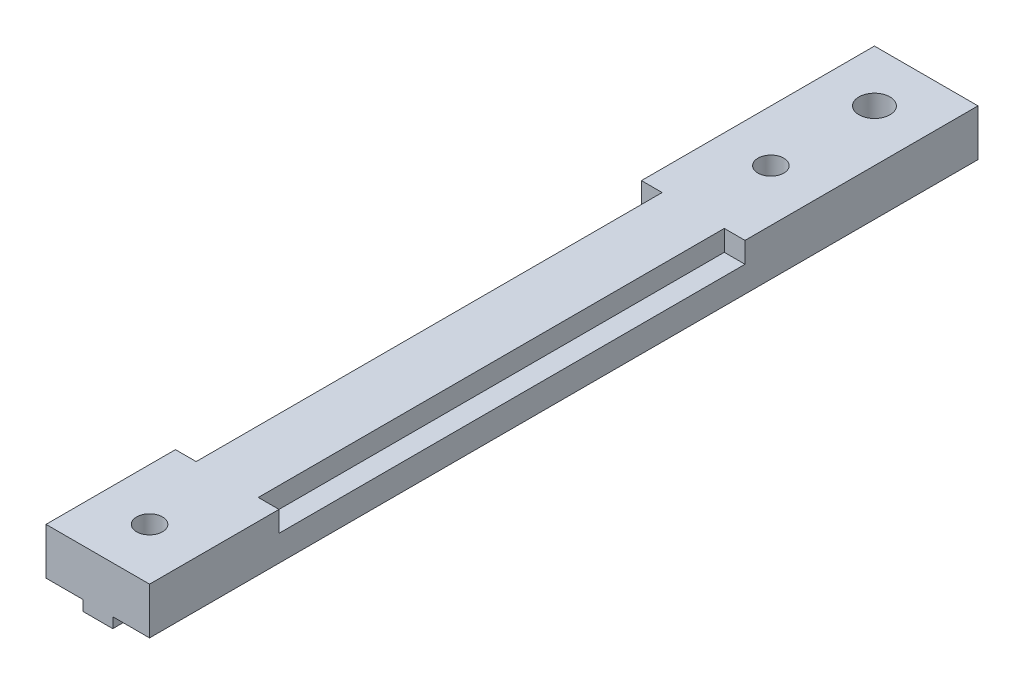
ISO-10303-21;
HEADER;
FILE_DESCRIPTION(('STEP AP214'),'2;1');
FILE_NAME('part.step','',(''),(''),'','','');
FILE_SCHEMA(('AUTOMOTIVE_DESIGN { 1 0 10303 214 1 1 1 1 }'));
ENDSEC;
DATA;
#1=APPLICATION_CONTEXT('core data for automotive mechanical design processes');
#2=APPLICATION_PROTOCOL_DEFINITION('international standard','automotive_design',2000,#1);
#3=PRODUCT_CONTEXT('',#1,'mechanical');
#4=PRODUCT('Part','Part','',(#3));
#5=PRODUCT_RELATED_PRODUCT_CATEGORY('part','',(#4));
#6=PRODUCT_DEFINITION_FORMATION('','',#4);
#7=PRODUCT_DEFINITION_CONTEXT('part definition',#1,'design');
#8=PRODUCT_DEFINITION('design','',#6,#7);
#9=PRODUCT_DEFINITION_SHAPE('','',#8);
#10=(LENGTH_UNIT() NAMED_UNIT(*) SI_UNIT(.MILLI.,.METRE.));
#11=(NAMED_UNIT(*) PLANE_ANGLE_UNIT() SI_UNIT($,.RADIAN.));
#12=(NAMED_UNIT(*) SI_UNIT($,.STERADIAN.) SOLID_ANGLE_UNIT());
#13=UNCERTAINTY_MEASURE_WITH_UNIT(LENGTH_MEASURE(1.E-05),#10,'distance_accuracy_value','');
#14=(GEOMETRIC_REPRESENTATION_CONTEXT(3) GLOBAL_UNCERTAINTY_ASSIGNED_CONTEXT((#13)) GLOBAL_UNIT_ASSIGNED_CONTEXT((#10,
#11,#12)) REPRESENTATION_CONTEXT('',''));
#15=CARTESIAN_POINT('',(0.,0.,0.));
#16=DIRECTION('',(0.,0.,1.));
#17=DIRECTION('',(1.,0.,0.));
#18=AXIS2_PLACEMENT_3D('',#15,#16,#17);
#19=CARTESIAN_POINT('',(-1.45,-5.5,80.));
#20=DIRECTION('',(1.,0.,0.));
#21=DIRECTION('',(0.,1.,0.));
#22=AXIS2_PLACEMENT_3D('',#19,#20,#21);
#23=PLANE('',#22);
#24=DIRECTION('',(0.,0.,-1.));
#25=VECTOR('',#24,1.);
#26=CARTESIAN_POINT('',(-1.45,-5.5,80.));
#27=LINE('',#26,#25);
#28=CARTESIAN_POINT('',(-1.45,-5.5,4.61594271260657));
#29=VERTEX_POINT('',#28);
#30=CARTESIAN_POINT('',(-1.45,-5.5,0.));
#31=VERTEX_POINT('',#30);
#32=EDGE_CURVE('E327',#29,#31,#27,.T.);
#33=ORIENTED_EDGE('',*,*,#32,.F.);
#34=DIRECTION('',(0.,1.,0.));
#35=VECTOR('',#34,1.);
#36=CARTESIAN_POINT('',(-1.45,-5.5,4.61594271260657));
#37=LINE('',#36,#35);
#38=CARTESIAN_POINT('',(-1.45,-4.5,4.61594271260658));
#39=VERTEX_POINT('',#38);
#40=EDGE_CURVE('E259',#29,#39,#37,.T.);
#41=ORIENTED_EDGE('',*,*,#40,.T.);
#42=DIRECTION('',(0.,0.,-1.));
#43=VECTOR('',#42,1.);
#44=CARTESIAN_POINT('',(-1.45,-4.5,80.));
#45=LINE('',#44,#43);
#46=CARTESIAN_POINT('',(-1.45,-4.5,0.));
#47=VERTEX_POINT('',#46);
#48=EDGE_CURVE('E330',#39,#47,#45,.T.);
#49=ORIENTED_EDGE('',*,*,#48,.T.);
#50=DIRECTION('',(0.,-1.,0.));
#51=VECTOR('',#50,1.);
#52=CARTESIAN_POINT('',(-1.45,-5.5,0.));
#53=LINE('',#52,#51);
#54=EDGE_CURVE('E293',#47,#31,#53,.T.);
#55=ORIENTED_EDGE('',*,*,#54,.T.);
#56=EDGE_LOOP('',(#33,#41,#49,#55));
#57=FACE_BOUND('',#56,.T.);
#58=ADVANCED_FACE('F32',(#57),#23,.F.);
#59=CARTESIAN_POINT('',(1.45,-5.5,80.));
#60=DIRECTION('',(0.,1.,0.));
#61=DIRECTION('',(0.,0.,1.));
#62=AXIS2_PLACEMENT_3D('',#59,#60,#61);
#63=PLANE('',#62);
#64=DIRECTION('',(0.,0.,-1.));
#65=VECTOR('',#64,1.);
#66=CARTESIAN_POINT('',(1.45,-5.5,80.));
#67=LINE('',#66,#65);
#68=CARTESIAN_POINT('',(1.45,-5.5,4.61594271260657));
#69=VERTEX_POINT('',#68);
#70=CARTESIAN_POINT('',(1.45,-5.5,0.));
#71=VERTEX_POINT('',#70);
#72=EDGE_CURVE('E323',#69,#71,#67,.T.);
#73=ORIENTED_EDGE('',*,*,#72,.F.);
#74=CARTESIAN_POINT('',(0.,-5.5,5.));
#75=DIRECTION('',(0.,1.,0.));
#76=DIRECTION('',(-1.,0.,0.));
#77=AXIS2_PLACEMENT_3D('',#74,#75,#76);
#78=CIRCLE('',#77,1.5);
#79=EDGE_CURVE('E242',#69,#29,#78,.T.);
#80=ORIENTED_EDGE('',*,*,#79,.T.);
#81=ORIENTED_EDGE('',*,*,#32,.T.);
#82=DIRECTION('',(1.,0.,0.));
#83=VECTOR('',#82,1.);
#84=CARTESIAN_POINT('',(1.45,-5.5,0.));
#85=LINE('',#84,#83);
#86=EDGE_CURVE('E296',#31,#71,#85,.T.);
#87=ORIENTED_EDGE('',*,*,#86,.T.);
#88=EDGE_LOOP('',(#73,#80,#81,#87));
#89=FACE_BOUND('',#88,.T.);
#90=ADVANCED_FACE('F350',(#89),#63,.F.);
#91=CARTESIAN_POINT('',(1.45,-4.5,80.));
#92=DIRECTION('',(-1.,0.,0.));
#93=DIRECTION('',(0.,0.,1.));
#94=AXIS2_PLACEMENT_3D('',#91,#92,#93);
#95=PLANE('',#94);
#96=CARTESIAN_POINT('',(1.45,-5.5,80.));
#97=VERTEX_POINT('',#96);
#98=CARTESIAN_POINT('',(1.45,-5.5,5.38405728739344));
#99=VERTEX_POINT('',#98);
#100=EDGE_CURVE('E324',#97,#99,#67,.T.);
#101=ORIENTED_EDGE('',*,*,#100,.T.);
#102=DIRECTION('',(0.,1.,0.));
#103=VECTOR('',#102,1.);
#104=CARTESIAN_POINT('',(1.45,-5.5,5.38405728739344));
#105=LINE('',#104,#103);
#106=CARTESIAN_POINT('',(1.45,-4.5,5.38405728739344));
#107=VERTEX_POINT('',#106);
#108=EDGE_CURVE('E250',#99,#107,#105,.T.);
#109=ORIENTED_EDGE('',*,*,#108,.T.);
#110=DIRECTION('',(0.,0.,-1.));
#111=VECTOR('',#110,1.);
#112=CARTESIAN_POINT('',(1.45,-4.5,80.));
#113=LINE('',#112,#111);
#114=CARTESIAN_POINT('',(1.45,-4.5,80.));
#115=VERTEX_POINT('',#114);
#116=EDGE_CURVE('E320',#115,#107,#113,.T.);
#117=ORIENTED_EDGE('',*,*,#116,.F.);
#118=DIRECTION('',(0.,1.,0.));
#119=VECTOR('',#118,1.);
#120=CARTESIAN_POINT('',(1.45,-4.5,80.));
#121=LINE('',#120,#119);
#122=EDGE_CURVE('E279',#97,#115,#121,.T.);
#123=ORIENTED_EDGE('',*,*,#122,.F.);
#124=EDGE_LOOP('',(#101,#109,#117,#123));
#125=FACE_BOUND('',#124,.T.);
#126=ADVANCED_FACE('F363',(#125),#95,.F.);
#127=CARTESIAN_POINT('',(-5.,-4.5,80.));
#128=DIRECTION('',(1.,0.,0.));
#129=DIRECTION('',(0.,0.,-1.));
#130=AXIS2_PLACEMENT_3D('',#127,#128,#129);
#131=PLANE('',#130);
#132=DIRECTION('',(0.,0.,1.));
#133=VECTOR('',#132,1.);
#134=CARTESIAN_POINT('',(-5.,-2.,22.5));
#135=LINE('',#134,#133);
#136=CARTESIAN_POINT('',(-5.,-2.,22.5));
#137=VERTEX_POINT('',#136);
#138=CARTESIAN_POINT('',(-4.99999999999999,-2.,67.5));
#139=VERTEX_POINT('',#138);
#140=EDGE_CURVE('E205',#137,#139,#135,.T.);
#141=ORIENTED_EDGE('',*,*,#140,.F.);
#142=DIRECTION('',(0.,1.,0.));
#143=VECTOR('',#142,1.);
#144=CARTESIAN_POINT('',(-5.,-2.,22.5));
#145=LINE('',#144,#143);
#146=CARTESIAN_POINT('',(-5.,0.,22.5));
#147=VERTEX_POINT('',#146);
#148=EDGE_CURVE('E223',#137,#147,#145,.T.);
#149=ORIENTED_EDGE('',*,*,#148,.T.);
#150=DIRECTION('',(0.,0.,-1.));
#151=VECTOR('',#150,1.);
#152=CARTESIAN_POINT('',(-5.,0.,80.));
#153=LINE('',#152,#151);
#154=CARTESIAN_POINT('',(-5.,0.,0.));
#155=VERTEX_POINT('',#154);
#156=EDGE_CURVE('E287',#147,#155,#153,.T.);
#157=ORIENTED_EDGE('',*,*,#156,.T.);
#158=DIRECTION('',(0.,-1.,0.));
#159=VECTOR('',#158,1.);
#160=CARTESIAN_POINT('',(-5.,-4.5,0.));
#161=LINE('',#160,#159);
#162=CARTESIAN_POINT('',(-5.,-4.5,0.));
#163=VERTEX_POINT('',#162);
#164=EDGE_CURVE('E266',#155,#163,#161,.T.);
#165=ORIENTED_EDGE('',*,*,#164,.T.);
#166=DIRECTION('',(0.,0.,-1.));
#167=VECTOR('',#166,1.);
#168=CARTESIAN_POINT('',(-5.,-4.5,80.));
#169=LINE('',#168,#167);
#170=CARTESIAN_POINT('',(-5.,-4.5,80.));
#171=VERTEX_POINT('',#170);
#172=EDGE_CURVE('E11',#171,#163,#169,.T.);
#173=ORIENTED_EDGE('',*,*,#172,.F.);
#174=DIRECTION('',(0.,-1.,0.));
#175=VECTOR('',#174,1.);
#176=CARTESIAN_POINT('',(-5.,-4.5,80.));
#177=LINE('',#176,#175);
#178=CARTESIAN_POINT('',(-5.,0.,80.));
#179=VERTEX_POINT('',#178);
#180=EDGE_CURVE('E269',#179,#171,#177,.T.);
#181=ORIENTED_EDGE('',*,*,#180,.F.);
#182=CARTESIAN_POINT('',(-5.,0.,67.5));
#183=VERTEX_POINT('',#182);
#184=EDGE_CURVE('E309',#179,#183,#153,.T.);
#185=ORIENTED_EDGE('',*,*,#184,.T.);
#186=DIRECTION('',(0.,1.,0.));
#187=VECTOR('',#186,1.);
#188=CARTESIAN_POINT('',(-4.99999999999999,-2.,67.5));
#189=LINE('',#188,#187);
#190=EDGE_CURVE('E55',#139,#183,#189,.T.);
#191=ORIENTED_EDGE('',*,*,#190,.F.);
#192=EDGE_LOOP('',(#141,#149,#157,#165,#173,#181,#185,#191));
#193=FACE_BOUND('',#192,.T.);
#194=ADVANCED_FACE('F34',(#193),#131,.F.);
#195=CARTESIAN_POINT('',(-1.45,-4.5,80.));
#196=DIRECTION('',(0.,1.,0.));
#197=DIRECTION('',(-1.,0.,0.));
#198=AXIS2_PLACEMENT_3D('',#195,#196,#197);
#199=PLANE('',#198);
#200=ORIENTED_EDGE('',*,*,#48,.F.);
#201=CARTESIAN_POINT('',(0.,-4.5,5.));
#202=DIRECTION('',(0.,1.,0.));
#203=DIRECTION('',(-1.,0.,0.));
#204=AXIS2_PLACEMENT_3D('',#201,#202,#203);
#205=CIRCLE('',#204,1.5);
#206=CARTESIAN_POINT('',(-1.45,-4.5,5.38405728739343));
#207=VERTEX_POINT('',#206);
#208=EDGE_CURVE('E256',#39,#207,#205,.T.);
#209=ORIENTED_EDGE('',*,*,#208,.T.);
#210=CARTESIAN_POINT('',(-1.45,-4.5,80.));
#211=VERTEX_POINT('',#210);
#212=EDGE_CURVE('E40',#211,#207,#45,.T.);
#213=ORIENTED_EDGE('',*,*,#212,.F.);
#214=DIRECTION('',(1.,0.,0.));
#215=VECTOR('',#214,1.);
#216=CARTESIAN_POINT('',(-1.45,-4.5,80.));
#217=LINE('',#216,#215);
#218=EDGE_CURVE('E272',#171,#211,#217,.T.);
#219=ORIENTED_EDGE('',*,*,#218,.F.);
#220=ORIENTED_EDGE('',*,*,#172,.T.);
#221=DIRECTION('',(1.,0.,0.));
#222=VECTOR('',#221,1.);
#223=CARTESIAN_POINT('',(-1.45,-4.5,0.));
#224=LINE('',#223,#222);
#225=EDGE_CURVE('E290',#163,#47,#224,.T.);
#226=ORIENTED_EDGE('',*,*,#225,.T.);
#227=EDGE_LOOP('',(#200,#209,#213,#219,#220,#226));
#228=FACE_BOUND('',#227,.T.);
#229=ADVANCED_FACE('F341',(#228),#199,.F.);
#230=ORIENTED_EDGE('',*,*,#212,.T.);
#231=DIRECTION('',(0.,1.,0.));
#232=VECTOR('',#231,1.);
#233=CARTESIAN_POINT('',(-1.45,-5.5,5.38405728739343));
#234=LINE('',#233,#232);
#235=CARTESIAN_POINT('',(-1.45,-5.5,5.38405728739343));
#236=VERTEX_POINT('',#235);
#237=EDGE_CURVE('E253',#207,#236,#234,.F.);
#238=ORIENTED_EDGE('',*,*,#237,.T.);
#239=CARTESIAN_POINT('',(-1.45,-5.5,80.));
#240=VERTEX_POINT('',#239);
#241=EDGE_CURVE('E328',#240,#236,#27,.T.);
#242=ORIENTED_EDGE('',*,*,#241,.F.);
#243=DIRECTION('',(0.,-1.,0.));
#244=VECTOR('',#243,1.);
#245=CARTESIAN_POINT('',(-1.45,-5.5,80.));
#246=LINE('',#245,#244);
#247=EDGE_CURVE('E275',#211,#240,#246,.T.);
#248=ORIENTED_EDGE('',*,*,#247,.F.);
#249=EDGE_LOOP('',(#230,#238,#242,#248));
#250=FACE_BOUND('',#249,.T.);
#251=ADVANCED_FACE('F370',(#250),#23,.F.);
#252=CARTESIAN_POINT('',(0.,-5.5,15.));
#253=DIRECTION('',(0.,1.,0.));
#254=DIRECTION('',(-1.,0.,0.));
#255=AXIS2_PLACEMENT_3D('',#252,#253,#254);
#256=CIRCLE('',#255,1.25);
#257=CARTESIAN_POINT('',(-1.25,-5.5,15.));
#258=VERTEX_POINT('',#257);
#259=EDGE_CURVE('E232',#258,#258,#256,.T.);
#260=ORIENTED_EDGE('',*,*,#259,.T.);
#261=EDGE_LOOP('',(#260));
#262=FACE_BOUND('',#261,.T.);
#263=CARTESIAN_POINT('',(0.,-5.5,75.));
#264=DIRECTION('',(0.,1.,0.));
#265=DIRECTION('',(-1.,0.,0.));
#266=AXIS2_PLACEMENT_3D('',#263,#264,#265);
#267=CIRCLE('',#266,1.25);
#268=CARTESIAN_POINT('',(-1.25,-5.5,75.));
#269=VERTEX_POINT('',#268);
#270=EDGE_CURVE('E263',#269,#269,#267,.T.);
#271=ORIENTED_EDGE('',*,*,#270,.T.);
#272=EDGE_LOOP('',(#271));
#273=FACE_BOUND('',#272,.T.);
#274=ORIENTED_EDGE('',*,*,#241,.T.);
#275=EDGE_CURVE('E239',#236,#99,#78,.T.);
#276=ORIENTED_EDGE('',*,*,#275,.T.);
#277=ORIENTED_EDGE('',*,*,#100,.F.);
#278=DIRECTION('',(1.,0.,0.));
#279=VECTOR('',#278,1.);
#280=CARTESIAN_POINT('',(1.45,-5.5,80.));
#281=LINE('',#280,#279);
#282=EDGE_CURVE('E277',#240,#97,#281,.T.);
#283=ORIENTED_EDGE('',*,*,#282,.F.);
#284=EDGE_LOOP('',(#274,#276,#277,#283));
#285=FACE_BOUND('',#284,.T.);
#286=ADVANCED_FACE('F368',(#262,#273,#285),#63,.F.);
#287=CARTESIAN_POINT('',(1.45,-4.5,4.61594271260657));
#288=VERTEX_POINT('',#287);
#289=CARTESIAN_POINT('',(1.45,-4.5,0.));
#290=VERTEX_POINT('',#289);
#291=EDGE_CURVE('E319',#288,#290,#113,.T.);
#292=ORIENTED_EDGE('',*,*,#291,.F.);
#293=DIRECTION('',(0.,1.,0.));
#294=VECTOR('',#293,1.);
#295=CARTESIAN_POINT('',(1.45,-5.5,4.61594271260657));
#296=LINE('',#295,#294);
#297=EDGE_CURVE('E247',#288,#69,#296,.F.);
#298=ORIENTED_EDGE('',*,*,#297,.T.);
#299=ORIENTED_EDGE('',*,*,#72,.T.);
#300=DIRECTION('',(0.,1.,0.));
#301=VECTOR('',#300,1.);
#302=CARTESIAN_POINT('',(1.45,-4.5,0.));
#303=LINE('',#302,#301);
#304=EDGE_CURVE('E299',#71,#290,#303,.T.);
#305=ORIENTED_EDGE('',*,*,#304,.T.);
#306=EDGE_LOOP('',(#292,#298,#299,#305));
#307=FACE_BOUND('',#306,.T.);
#308=ADVANCED_FACE('F356',(#307),#95,.F.);
#309=CARTESIAN_POINT('',(5.,-4.5,80.));
#310=DIRECTION('',(0.,1.,0.));
#311=DIRECTION('',(-1.,0.,0.));
#312=AXIS2_PLACEMENT_3D('',#309,#310,#311);
#313=PLANE('',#312);
#314=ORIENTED_EDGE('',*,*,#116,.T.);
#315=CARTESIAN_POINT('',(0.,-4.5,5.));
#316=DIRECTION('',(0.,1.,0.));
#317=DIRECTION('',(-1.,0.,0.));
#318=AXIS2_PLACEMENT_3D('',#315,#316,#317);
#319=CIRCLE('',#318,1.5);
#320=EDGE_CURVE('E235',#107,#288,#319,.T.);
#321=ORIENTED_EDGE('',*,*,#320,.T.);
#322=ORIENTED_EDGE('',*,*,#291,.T.);
#323=DIRECTION('',(1.,0.,0.));
#324=VECTOR('',#323,1.);
#325=CARTESIAN_POINT('',(5.,-4.5,0.));
#326=LINE('',#325,#324);
#327=CARTESIAN_POINT('',(5.,-4.5,0.));
#328=VERTEX_POINT('',#327);
#329=EDGE_CURVE('E302',#290,#328,#326,.T.);
#330=ORIENTED_EDGE('',*,*,#329,.T.);
#331=DIRECTION('',(0.,0.,-1.));
#332=VECTOR('',#331,1.);
#333=CARTESIAN_POINT('',(5.,-4.5,80.));
#334=LINE('',#333,#332);
#335=CARTESIAN_POINT('',(5.,-4.5,80.));
#336=VERTEX_POINT('',#335);
#337=EDGE_CURVE('E316',#336,#328,#334,.T.);
#338=ORIENTED_EDGE('',*,*,#337,.F.);
#339=DIRECTION('',(1.,0.,0.));
#340=VECTOR('',#339,1.);
#341=CARTESIAN_POINT('',(5.,-4.5,80.));
#342=LINE('',#341,#340);
#343=EDGE_CURVE('E281',#115,#336,#342,.T.);
#344=ORIENTED_EDGE('',*,*,#343,.F.);
#345=EDGE_LOOP('',(#314,#321,#322,#330,#338,#344));
#346=FACE_BOUND('',#345,.T.);
#347=ADVANCED_FACE('F358',(#346),#313,.F.);
#348=CARTESIAN_POINT('',(5.,0.,80.));
#349=DIRECTION('',(-1.,0.,0.));
#350=DIRECTION('',(0.,-1.,0.));
#351=AXIS2_PLACEMENT_3D('',#348,#349,#350);
#352=PLANE('',#351);
#353=DIRECTION('',(0.,0.,-1.));
#354=VECTOR('',#353,1.);
#355=CARTESIAN_POINT('',(5.,0.,80.));
#356=LINE('',#355,#354);
#357=CARTESIAN_POINT('',(5.,0.,22.5));
#358=VERTEX_POINT('',#357);
#359=CARTESIAN_POINT('',(5.,0.,0.));
#360=VERTEX_POINT('',#359);
#361=EDGE_CURVE('E312',#358,#360,#356,.T.);
#362=ORIENTED_EDGE('',*,*,#361,.F.);
#363=DIRECTION('',(0.,1.,0.));
#364=VECTOR('',#363,1.);
#365=CARTESIAN_POINT('',(5.,-2.,22.5));
#366=LINE('',#365,#364);
#367=CARTESIAN_POINT('',(5.,-2.,22.5));
#368=VERTEX_POINT('',#367);
#369=EDGE_CURVE('E202',#368,#358,#366,.T.);
#370=ORIENTED_EDGE('',*,*,#369,.F.);
#371=DIRECTION('',(0.,0.,-1.));
#372=VECTOR('',#371,1.);
#373=CARTESIAN_POINT('',(5.,-2.,22.5));
#374=LINE('',#373,#372);
#375=CARTESIAN_POINT('',(5.,-2.,67.5));
#376=VERTEX_POINT('',#375);
#377=EDGE_CURVE('E185',#376,#368,#374,.T.);
#378=ORIENTED_EDGE('',*,*,#377,.F.);
#379=DIRECTION('',(0.,1.,0.));
#380=VECTOR('',#379,1.);
#381=CARTESIAN_POINT('',(5.,-2.,67.5));
#382=LINE('',#381,#380);
#383=CARTESIAN_POINT('',(5.,0.,67.5));
#384=VERTEX_POINT('',#383);
#385=EDGE_CURVE('E176',#376,#384,#382,.T.);
#386=ORIENTED_EDGE('',*,*,#385,.T.);
#387=CARTESIAN_POINT('',(5.,0.,80.));
#388=VERTEX_POINT('',#387);
#389=EDGE_CURVE('E313',#388,#384,#356,.T.);
#390=ORIENTED_EDGE('',*,*,#389,.F.);
#391=DIRECTION('',(0.,1.,0.));
#392=VECTOR('',#391,1.);
#393=CARTESIAN_POINT('',(5.,0.,80.));
#394=LINE('',#393,#392);
#395=EDGE_CURVE('E283',#336,#388,#394,.T.);
#396=ORIENTED_EDGE('',*,*,#395,.F.);
#397=ORIENTED_EDGE('',*,*,#337,.T.);
#398=DIRECTION('',(0.,1.,0.));
#399=VECTOR('',#398,1.);
#400=CARTESIAN_POINT('',(5.,0.,0.));
#401=LINE('',#400,#399);
#402=EDGE_CURVE('E304',#328,#360,#401,.T.);
#403=ORIENTED_EDGE('',*,*,#402,.T.);
#404=EDGE_LOOP('',(#362,#370,#378,#386,#390,#396,#397,#403));
#405=FACE_BOUND('',#404,.T.);
#406=ADVANCED_FACE('F388',(#405),#352,.F.);
#407=CARTESIAN_POINT('',(-5.,0.,80.));
#408=DIRECTION('',(0.,-1.,0.));
#409=DIRECTION('',(1.,0.,0.));
#410=AXIS2_PLACEMENT_3D('',#407,#408,#409);
#411=PLANE('',#410);
#412=CARTESIAN_POINT('',(0.,0.,15.));
#413=DIRECTION('',(0.,1.,0.));
#414=DIRECTION('',(-1.,0.,0.));
#415=AXIS2_PLACEMENT_3D('',#412,#413,#414);
#416=CIRCLE('',#415,1.25);
#417=CARTESIAN_POINT('',(-1.25,0.,15.));
#418=VERTEX_POINT('',#417);
#419=EDGE_CURVE('E236',#418,#418,#416,.T.);
#420=ORIENTED_EDGE('',*,*,#419,.F.);
#421=EDGE_LOOP('',(#420));
#422=FACE_BOUND('',#421,.T.);
#423=CARTESIAN_POINT('',(0.,0.,5.));
#424=DIRECTION('',(0.,1.,0.));
#425=DIRECTION('',(-1.,0.,0.));
#426=AXIS2_PLACEMENT_3D('',#423,#424,#425);
#427=CIRCLE('',#426,1.5);
#428=CARTESIAN_POINT('',(-1.5,0.,5.));
#429=VERTEX_POINT('',#428);
#430=EDGE_CURVE('E226',#429,#429,#427,.T.);
#431=ORIENTED_EDGE('',*,*,#430,.F.);
#432=EDGE_LOOP('',(#431));
#433=FACE_BOUND('',#432,.T.);
#434=CARTESIAN_POINT('',(0.,0.,75.));
#435=DIRECTION('',(0.,1.,0.));
#436=DIRECTION('',(-1.,0.,0.));
#437=AXIS2_PLACEMENT_3D('',#434,#435,#436);
#438=CIRCLE('',#437,1.25);
#439=CARTESIAN_POINT('',(-1.25,0.,75.));
#440=VERTEX_POINT('',#439);
#441=EDGE_CURVE('E262',#440,#440,#438,.T.);
#442=ORIENTED_EDGE('',*,*,#441,.F.);
#443=EDGE_LOOP('',(#442));
#444=FACE_BOUND('',#443,.T.);
#445=DIRECTION('',(0.,0.,1.));
#446=VECTOR('',#445,1.);
#447=CARTESIAN_POINT('',(3.,0.,22.5));
#448=LINE('',#447,#446);
#449=CARTESIAN_POINT('',(3.,0.,22.5));
#450=VERTEX_POINT('',#449);
#451=CARTESIAN_POINT('',(3.,0.,67.5));
#452=VERTEX_POINT('',#451);
#453=EDGE_CURVE('E47',#450,#452,#448,.T.);
#454=ORIENTED_EDGE('',*,*,#453,.F.);
#455=DIRECTION('',(-1.,0.,0.));
#456=VECTOR('',#455,1.);
#457=CARTESIAN_POINT('',(3.,0.,22.5));
#458=LINE('',#457,#456);
#459=EDGE_CURVE('E189',#358,#450,#458,.T.);
#460=ORIENTED_EDGE('',*,*,#459,.F.);
#461=ORIENTED_EDGE('',*,*,#361,.T.);
#462=DIRECTION('',(-1.,0.,0.));
#463=VECTOR('',#462,1.);
#464=CARTESIAN_POINT('',(-5.,0.,0.));
#465=LINE('',#464,#463);
#466=EDGE_CURVE('E273',#360,#155,#465,.T.);
#467=ORIENTED_EDGE('',*,*,#466,.T.);
#468=ORIENTED_EDGE('',*,*,#156,.F.);
#469=DIRECTION('',(-1.,0.,0.));
#470=VECTOR('',#469,1.);
#471=CARTESIAN_POINT('',(-5.,0.,22.5));
#472=LINE('',#471,#470);
#473=CARTESIAN_POINT('',(-3.,0.,22.5));
#474=VERTEX_POINT('',#473);
#475=EDGE_CURVE('E209',#474,#147,#472,.T.);
#476=ORIENTED_EDGE('',*,*,#475,.F.);
#477=DIRECTION('',(0.,0.,-1.));
#478=VECTOR('',#477,1.);
#479=CARTESIAN_POINT('',(-3.,0.,22.5));
#480=LINE('',#479,#478);
#481=CARTESIAN_POINT('',(-3.,0.,67.5));
#482=VERTEX_POINT('',#481);
#483=EDGE_CURVE('E219',#482,#474,#480,.T.);
#484=ORIENTED_EDGE('',*,*,#483,.F.);
#485=DIRECTION('',(1.,0.,0.));
#486=VECTOR('',#485,1.);
#487=CARTESIAN_POINT('',(-4.99999999999999,0.,67.5));
#488=LINE('',#487,#486);
#489=EDGE_CURVE('E201',#183,#482,#488,.T.);
#490=ORIENTED_EDGE('',*,*,#489,.F.);
#491=ORIENTED_EDGE('',*,*,#184,.F.);
#492=DIRECTION('',(-1.,0.,0.));
#493=VECTOR('',#492,1.);
#494=CARTESIAN_POINT('',(-5.,0.,80.));
#495=LINE('',#494,#493);
#496=EDGE_CURVE('E285',#388,#179,#495,.T.);
#497=ORIENTED_EDGE('',*,*,#496,.F.);
#498=ORIENTED_EDGE('',*,*,#389,.T.);
#499=DIRECTION('',(1.,0.,0.));
#500=VECTOR('',#499,1.);
#501=CARTESIAN_POINT('',(3.,0.,67.5));
#502=LINE('',#501,#500);
#503=EDGE_CURVE('E192',#452,#384,#502,.T.);
#504=ORIENTED_EDGE('',*,*,#503,.F.);
#505=EDGE_LOOP('',(#454,#460,#461,#467,#468,#476,#484,#490,#491,#497,#498,#504));
#506=FACE_BOUND('',#505,.T.);
#507=ADVANCED_FACE('F382',(#422,#433,#444,#506),#411,.F.);
#508=CARTESIAN_POINT('',(0.,0.,80.));
#509=DIRECTION('',(0.,0.,-1.));
#510=DIRECTION('',(-1.,0.,0.));
#511=AXIS2_PLACEMENT_3D('',#508,#509,#510);
#512=PLANE('',#511);
#513=ORIENTED_EDGE('',*,*,#180,.T.);
#514=ORIENTED_EDGE('',*,*,#218,.T.);
#515=ORIENTED_EDGE('',*,*,#247,.T.);
#516=ORIENTED_EDGE('',*,*,#282,.T.);
#517=ORIENTED_EDGE('',*,*,#122,.T.);
#518=ORIENTED_EDGE('',*,*,#343,.T.);
#519=ORIENTED_EDGE('',*,*,#395,.T.);
#520=ORIENTED_EDGE('',*,*,#496,.T.);
#521=EDGE_LOOP('',(#513,#514,#515,#516,#517,#518,#519,#520));
#522=FACE_BOUND('',#521,.T.);
#523=ADVANCED_FACE('F372',(#522),#512,.F.);
#524=CARTESIAN_POINT('',(0.,0.,0.));
#525=DIRECTION('',(0.,0.,-1.));
#526=DIRECTION('',(-1.,0.,0.));
#527=AXIS2_PLACEMENT_3D('',#524,#525,#526);
#528=PLANE('',#527);
#529=ORIENTED_EDGE('',*,*,#164,.F.);
#530=ORIENTED_EDGE('',*,*,#466,.F.);
#531=ORIENTED_EDGE('',*,*,#402,.F.);
#532=ORIENTED_EDGE('',*,*,#329,.F.);
#533=ORIENTED_EDGE('',*,*,#304,.F.);
#534=ORIENTED_EDGE('',*,*,#86,.F.);
#535=ORIENTED_EDGE('',*,*,#54,.F.);
#536=ORIENTED_EDGE('',*,*,#225,.F.);
#537=EDGE_LOOP('',(#529,#530,#531,#532,#533,#534,#535,#536));
#538=FACE_BOUND('',#537,.T.);
#539=ADVANCED_FACE('F345',(#538),#528,.T.);
#540=CARTESIAN_POINT('',(0.,-5.5,75.));
#541=DIRECTION('',(0.,1.,0.));
#542=DIRECTION('',(-1.,0.,0.));
#543=AXIS2_PLACEMENT_3D('',#540,#541,#542);
#544=CYLINDRICAL_SURFACE('',#543,1.25);
#545=ORIENTED_EDGE('',*,*,#270,.F.);
#546=EDGE_LOOP('',(#545));
#547=FACE_BOUND('',#546,.T.);
#548=ORIENTED_EDGE('',*,*,#441,.T.);
#549=EDGE_LOOP('',(#548));
#550=FACE_BOUND('',#549,.T.);
#551=ADVANCED_FACE('F448',(#547,#550),#544,.F.);
#552=CARTESIAN_POINT('',(0.,-5.5,5.));
#553=DIRECTION('',(0.,1.,0.));
#554=DIRECTION('',(-1.,0.,0.));
#555=AXIS2_PLACEMENT_3D('',#552,#553,#554);
#556=CYLINDRICAL_SURFACE('',#555,1.5);
#557=ORIENTED_EDGE('',*,*,#430,.T.);
#558=EDGE_LOOP('',(#557));
#559=FACE_BOUND('',#558,.T.);
#560=ORIENTED_EDGE('',*,*,#79,.F.);
#561=ORIENTED_EDGE('',*,*,#297,.F.);
#562=ORIENTED_EDGE('',*,*,#320,.F.);
#563=ORIENTED_EDGE('',*,*,#108,.F.);
#564=ORIENTED_EDGE('',*,*,#275,.F.);
#565=ORIENTED_EDGE('',*,*,#237,.F.);
#566=ORIENTED_EDGE('',*,*,#208,.F.);
#567=ORIENTED_EDGE('',*,*,#40,.F.);
#568=EDGE_LOOP('',(#560,#561,#562,#563,#564,#565,#566,#567));
#569=FACE_BOUND('',#568,.T.);
#570=ADVANCED_FACE('F353',(#559,#569),#556,.F.);
#571=CARTESIAN_POINT('',(0.,-5.5,15.));
#572=DIRECTION('',(0.,1.,0.));
#573=DIRECTION('',(-1.,0.,0.));
#574=AXIS2_PLACEMENT_3D('',#571,#572,#573);
#575=CYLINDRICAL_SURFACE('',#574,1.25);
#576=ORIENTED_EDGE('',*,*,#259,.F.);
#577=EDGE_LOOP('',(#576));
#578=FACE_BOUND('',#577,.T.);
#579=ORIENTED_EDGE('',*,*,#419,.T.);
#580=EDGE_LOOP('',(#579));
#581=FACE_BOUND('',#580,.T.);
#582=ADVANCED_FACE('F455',(#578,#581),#575,.F.);
#583=CARTESIAN_POINT('',(-5.,-2.,22.5));
#584=DIRECTION('',(0.,0.,-1.));
#585=DIRECTION('',(-1.,0.,0.));
#586=AXIS2_PLACEMENT_3D('',#583,#584,#585);
#587=PLANE('',#586);
#588=ORIENTED_EDGE('',*,*,#475,.T.);
#589=ORIENTED_EDGE('',*,*,#148,.F.);
#590=DIRECTION('',(-1.,0.,0.));
#591=VECTOR('',#590,1.);
#592=CARTESIAN_POINT('',(-5.,-2.,22.5));
#593=LINE('',#592,#591);
#594=CARTESIAN_POINT('',(-3.,-2.,22.5));
#595=VERTEX_POINT('',#594);
#596=EDGE_CURVE('E215',#595,#137,#593,.T.);
#597=ORIENTED_EDGE('',*,*,#596,.F.);
#598=DIRECTION('',(0.,1.,0.));
#599=VECTOR('',#598,1.);
#600=CARTESIAN_POINT('',(-3.,-2.,22.5));
#601=LINE('',#600,#599);
#602=EDGE_CURVE('E227',#595,#474,#601,.T.);
#603=ORIENTED_EDGE('',*,*,#602,.T.);
#604=EDGE_LOOP('',(#588,#589,#597,#603));
#605=FACE_BOUND('',#604,.T.);
#606=ADVANCED_FACE('F397',(#605),#587,.F.);
#607=CARTESIAN_POINT('',(-3.,-2.,22.5));
#608=DIRECTION('',(1.,0.,0.));
#609=DIRECTION('',(0.,1.,0.));
#610=AXIS2_PLACEMENT_3D('',#607,#608,#609);
#611=PLANE('',#610);
#612=ORIENTED_EDGE('',*,*,#483,.T.);
#613=ORIENTED_EDGE('',*,*,#602,.F.);
#614=DIRECTION('',(0.,0.,-1.));
#615=VECTOR('',#614,1.);
#616=CARTESIAN_POINT('',(-3.,-2.,22.5));
#617=LINE('',#616,#615);
#618=CARTESIAN_POINT('',(-3.,-2.,67.5));
#619=VERTEX_POINT('',#618);
#620=EDGE_CURVE('E212',#619,#595,#617,.T.);
#621=ORIENTED_EDGE('',*,*,#620,.F.);
#622=DIRECTION('',(0.,1.,0.));
#623=VECTOR('',#622,1.);
#624=CARTESIAN_POINT('',(-3.,-2.,67.5));
#625=LINE('',#624,#623);
#626=EDGE_CURVE('E229',#619,#482,#625,.T.);
#627=ORIENTED_EDGE('',*,*,#626,.T.);
#628=EDGE_LOOP('',(#612,#613,#621,#627));
#629=FACE_BOUND('',#628,.T.);
#630=ADVANCED_FACE('F399',(#629),#611,.F.);
#631=CARTESIAN_POINT('',(-4.99999999999999,-2.,67.5));
#632=DIRECTION('',(0.,0.,1.));
#633=DIRECTION('',(1.,0.,0.));
#634=AXIS2_PLACEMENT_3D('',#631,#632,#633);
#635=PLANE('',#634);
#636=ORIENTED_EDGE('',*,*,#489,.T.);
#637=ORIENTED_EDGE('',*,*,#626,.F.);
#638=DIRECTION('',(1.,0.,0.));
#639=VECTOR('',#638,1.);
#640=CARTESIAN_POINT('',(-4.99999999999999,-2.,67.5));
#641=LINE('',#640,#639);
#642=EDGE_CURVE('E208',#139,#619,#641,.T.);
#643=ORIENTED_EDGE('',*,*,#642,.F.);
#644=ORIENTED_EDGE('',*,*,#190,.T.);
#645=EDGE_LOOP('',(#636,#637,#643,#644));
#646=FACE_BOUND('',#645,.T.);
#647=ADVANCED_FACE('F400',(#646),#635,.F.);
#648=CARTESIAN_POINT('',(0.,-2.,0.));
#649=DIRECTION('',(0.,1.,0.));
#650=DIRECTION('',(-1.,0.,0.));
#651=AXIS2_PLACEMENT_3D('',#648,#649,#650);
#652=PLANE('',#651);
#653=ORIENTED_EDGE('',*,*,#140,.T.);
#654=ORIENTED_EDGE('',*,*,#642,.T.);
#655=ORIENTED_EDGE('',*,*,#620,.T.);
#656=ORIENTED_EDGE('',*,*,#596,.T.);
#657=EDGE_LOOP('',(#653,#654,#655,#656));
#658=FACE_BOUND('',#657,.T.);
#659=ADVANCED_FACE('F393',(#658),#652,.T.);
#660=CARTESIAN_POINT('',(3.,-2.,22.5));
#661=DIRECTION('',(-1.,0.,0.));
#662=DIRECTION('',(0.,-1.,0.));
#663=AXIS2_PLACEMENT_3D('',#660,#661,#662);
#664=PLANE('',#663);
#665=ORIENTED_EDGE('',*,*,#453,.T.);
#666=DIRECTION('',(0.,1.,0.));
#667=VECTOR('',#666,1.);
#668=CARTESIAN_POINT('',(3.,-2.,67.5));
#669=LINE('',#668,#667);
#670=CARTESIAN_POINT('',(3.,-2.,67.5));
#671=VERTEX_POINT('',#670);
#672=EDGE_CURVE('E168',#671,#452,#669,.T.);
#673=ORIENTED_EDGE('',*,*,#672,.F.);
#674=DIRECTION('',(0.,0.,1.));
#675=VECTOR('',#674,1.);
#676=CARTESIAN_POINT('',(3.,-2.,22.5));
#677=LINE('',#676,#675);
#678=CARTESIAN_POINT('',(3.,-2.,22.5));
#679=VERTEX_POINT('',#678);
#680=EDGE_CURVE('E172',#679,#671,#677,.T.);
#681=ORIENTED_EDGE('',*,*,#680,.F.);
#682=DIRECTION('',(0.,1.,0.));
#683=VECTOR('',#682,1.);
#684=CARTESIAN_POINT('',(3.,-2.,22.5));
#685=LINE('',#684,#683);
#686=EDGE_CURVE('E199',#679,#450,#685,.T.);
#687=ORIENTED_EDGE('',*,*,#686,.T.);
#688=EDGE_LOOP('',(#665,#673,#681,#687));
#689=FACE_BOUND('',#688,.T.);
#690=ADVANCED_FACE('F170',(#689),#664,.F.);
#691=CARTESIAN_POINT('',(3.,-2.,22.5));
#692=DIRECTION('',(0.,0.,-1.));
#693=DIRECTION('',(-1.,0.,0.));
#694=AXIS2_PLACEMENT_3D('',#691,#692,#693);
#695=PLANE('',#694);
#696=ORIENTED_EDGE('',*,*,#459,.T.);
#697=ORIENTED_EDGE('',*,*,#686,.F.);
#698=DIRECTION('',(-1.,0.,0.));
#699=VECTOR('',#698,1.);
#700=CARTESIAN_POINT('',(3.,-2.,22.5));
#701=LINE('',#700,#699);
#702=EDGE_CURVE('E177',#368,#679,#701,.T.);
#703=ORIENTED_EDGE('',*,*,#702,.F.);
#704=ORIENTED_EDGE('',*,*,#369,.T.);
#705=EDGE_LOOP('',(#696,#697,#703,#704));
#706=FACE_BOUND('',#705,.T.);
#707=ADVANCED_FACE('F477',(#706),#695,.F.);
#708=CARTESIAN_POINT('',(3.,-2.,67.5));
#709=DIRECTION('',(0.,0.,1.));
#710=DIRECTION('',(1.,0.,0.));
#711=AXIS2_PLACEMENT_3D('',#708,#709,#710);
#712=PLANE('',#711);
#713=ORIENTED_EDGE('',*,*,#503,.T.);
#714=ORIENTED_EDGE('',*,*,#385,.F.);
#715=DIRECTION('',(1.,0.,0.));
#716=VECTOR('',#715,1.);
#717=CARTESIAN_POINT('',(3.,-2.,67.5));
#718=LINE('',#717,#716);
#719=EDGE_CURVE('E180',#671,#376,#718,.T.);
#720=ORIENTED_EDGE('',*,*,#719,.F.);
#721=ORIENTED_EDGE('',*,*,#672,.T.);
#722=EDGE_LOOP('',(#713,#714,#720,#721));
#723=FACE_BOUND('',#722,.T.);
#724=ADVANCED_FACE('F181',(#723),#712,.F.);
#725=CARTESIAN_POINT('',(0.,-2.,0.));
#726=DIRECTION('',(0.,1.,0.));
#727=DIRECTION('',(-1.,0.,0.));
#728=AXIS2_PLACEMENT_3D('',#725,#726,#727);
#729=PLANE('',#728);
#730=ORIENTED_EDGE('',*,*,#680,.T.);
#731=ORIENTED_EDGE('',*,*,#719,.T.);
#732=ORIENTED_EDGE('',*,*,#377,.T.);
#733=ORIENTED_EDGE('',*,*,#702,.T.);
#734=EDGE_LOOP('',(#730,#731,#732,#733));
#735=FACE_BOUND('',#734,.T.);
#736=ADVANCED_FACE('F187',(#735),#729,.T.);
#737=CLOSED_SHELL('',(#58,#90,#126,#194,#229,#251,#286,#308,#347,#406,#507,#523,#539,#551,#570,
#582,#606,#630,#647,#659,#690,#707,#724,#736));
#738=MANIFOLD_SOLID_BREP('B2',#737);
#739=ADVANCED_BREP_SHAPE_REPRESENTATION('',(#18,#738),#14);
#740=SHAPE_DEFINITION_REPRESENTATION(#9,#739);
ENDSEC;
END-ISO-10303-21;
